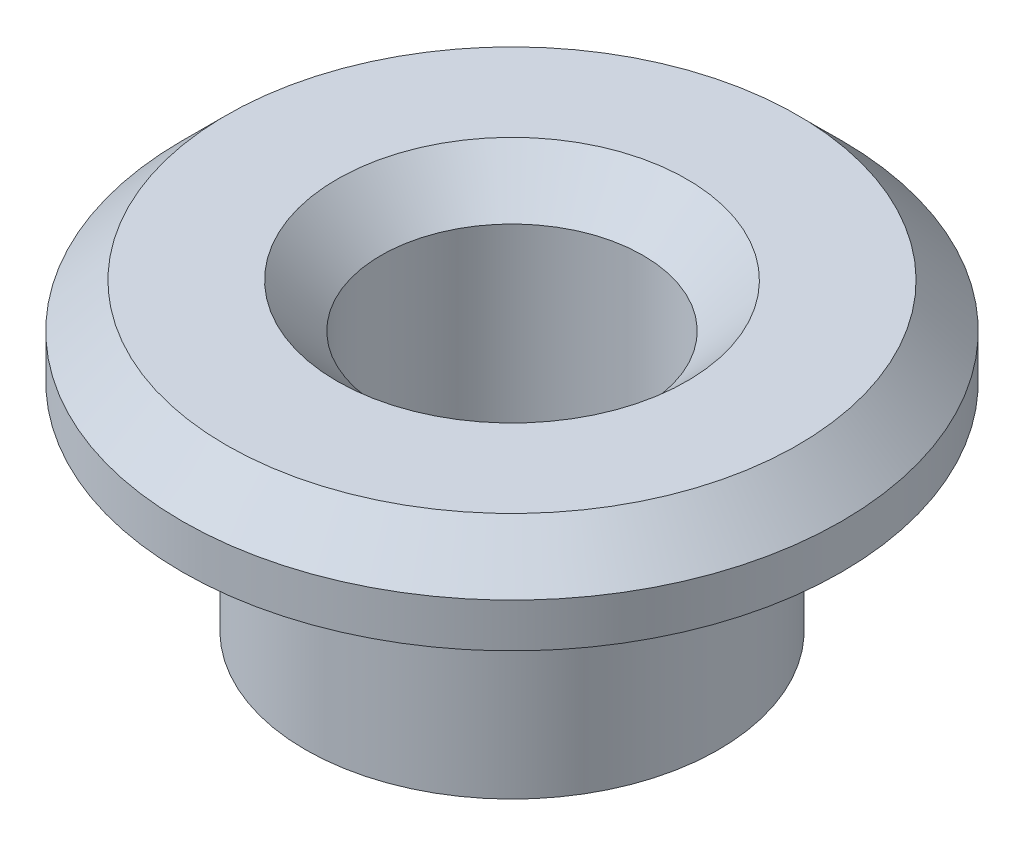
ISO-10303-21;
HEADER;
FILE_DESCRIPTION(('STEP AP214'),'2;1');
FILE_NAME('part.step','',(''),(''),'','','');
FILE_SCHEMA(('AUTOMOTIVE_DESIGN { 1 0 10303 214 1 1 1 1 }'));
ENDSEC;
DATA;
#1=APPLICATION_CONTEXT('core data for automotive mechanical design processes');
#2=APPLICATION_PROTOCOL_DEFINITION('international standard','automotive_design',2000,#1);
#3=PRODUCT_CONTEXT('',#1,'mechanical');
#4=PRODUCT('Part','Part','',(#3));
#5=PRODUCT_RELATED_PRODUCT_CATEGORY('part','',(#4));
#6=PRODUCT_DEFINITION_FORMATION('','',#4);
#7=PRODUCT_DEFINITION_CONTEXT('part definition',#1,'design');
#8=PRODUCT_DEFINITION('design','',#6,#7);
#9=PRODUCT_DEFINITION_SHAPE('','',#8);
#10=(LENGTH_UNIT() NAMED_UNIT(*) SI_UNIT(.MILLI.,.METRE.));
#11=(NAMED_UNIT(*) PLANE_ANGLE_UNIT() SI_UNIT($,.RADIAN.));
#12=(NAMED_UNIT(*) SI_UNIT($,.STERADIAN.) SOLID_ANGLE_UNIT());
#13=UNCERTAINTY_MEASURE_WITH_UNIT(LENGTH_MEASURE(1.E-05),#10,'distance_accuracy_value','');
#14=(GEOMETRIC_REPRESENTATION_CONTEXT(3) GLOBAL_UNCERTAINTY_ASSIGNED_CONTEXT((#13)) GLOBAL_UNIT_ASSIGNED_CONTEXT((#10,
#11,#12)) REPRESENTATION_CONTEXT('',''));
#15=CARTESIAN_POINT('',(0.,0.,0.));
#16=DIRECTION('',(0.,0.,1.));
#17=DIRECTION('',(1.,0.,0.));
#18=AXIS2_PLACEMENT_3D('',#15,#16,#17);
#19=CARTESIAN_POINT('',(0.,4.9,0.));
#20=DIRECTION('',(0.,-1.,0.));
#21=DIRECTION('',(0.,0.,-1.));
#22=AXIS2_PLACEMENT_3D('',#19,#20,#21);
#23=CYLINDRICAL_SURFACE('',#22,4.7);
#24=CARTESIAN_POINT('',(0.,4.9,0.));
#25=DIRECTION('',(0.,1.,0.));
#26=DIRECTION('',(0.,0.,1.));
#27=AXIS2_PLACEMENT_3D('',#24,#25,#26);
#28=CIRCLE('',#27,4.7);
#29=CARTESIAN_POINT('',(0.,4.9,4.7));
#30=VERTEX_POINT('',#29);
#31=EDGE_CURVE('E51',#30,#30,#28,.T.);
#32=ORIENTED_EDGE('',*,*,#31,.F.);
#33=EDGE_LOOP('',(#32));
#34=FACE_BOUND('',#33,.T.);
#35=CARTESIAN_POINT('',(0.,0.,0.));
#36=DIRECTION('',(0.,1.,0.));
#37=DIRECTION('',(0.,0.,1.));
#38=AXIS2_PLACEMENT_3D('',#35,#36,#37);
#39=CIRCLE('',#38,4.7);
#40=CARTESIAN_POINT('',(0.,0.,4.7));
#41=VERTEX_POINT('',#40);
#42=EDGE_CURVE('E52',#41,#41,#39,.T.);
#43=ORIENTED_EDGE('',*,*,#42,.T.);
#44=EDGE_LOOP('',(#43));
#45=FACE_BOUND('',#44,.T.);
#46=ADVANCED_FACE('F31',(#34,#45),#23,.T.);
#47=CARTESIAN_POINT('',(0.,0.,0.));
#48=DIRECTION('',(0.,1.,0.));
#49=DIRECTION('',(0.,0.,1.));
#50=AXIS2_PLACEMENT_3D('',#47,#48,#49);
#51=PLANE('',#50);
#52=CARTESIAN_POINT('',(0.,0.,0.));
#53=DIRECTION('',(0.,1.,0.));
#54=DIRECTION('',(0.,0.,1.));
#55=AXIS2_PLACEMENT_3D('',#52,#53,#54);
#56=CIRCLE('',#55,2.98);
#57=CARTESIAN_POINT('',(0.,0.,2.98));
#58=VERTEX_POINT('',#57);
#59=EDGE_CURVE('E60',#58,#58,#56,.T.);
#60=ORIENTED_EDGE('',*,*,#59,.T.);
#61=EDGE_LOOP('',(#60));
#62=FACE_BOUND('',#61,.T.);
#63=ORIENTED_EDGE('',*,*,#42,.F.);
#64=EDGE_LOOP('',(#63));
#65=FACE_BOUND('',#64,.T.);
#66=ADVANCED_FACE('F64',(#62,#65),#51,.F.);
#67=CARTESIAN_POINT('',(0.,4.9,0.));
#68=DIRECTION('',(0.,1.,0.));
#69=DIRECTION('',(0.,0.,1.));
#70=AXIS2_PLACEMENT_3D('',#67,#68,#69);
#71=PLANE('',#70);
#72=CARTESIAN_POINT('',(0.,4.9,0.));
#73=DIRECTION('',(0.,1.,0.));
#74=DIRECTION('',(0.,0.,1.));
#75=AXIS2_PLACEMENT_3D('',#72,#73,#74);
#76=CIRCLE('',#75,7.5);
#77=CARTESIAN_POINT('',(0.,4.9,7.5));
#78=VERTEX_POINT('',#77);
#79=EDGE_CURVE('E55',#78,#78,#76,.T.);
#80=ORIENTED_EDGE('',*,*,#79,.F.);
#81=EDGE_LOOP('',(#80));
#82=FACE_BOUND('',#81,.T.);
#83=ORIENTED_EDGE('',*,*,#31,.T.);
#84=EDGE_LOOP('',(#83));
#85=FACE_BOUND('',#84,.T.);
#86=ADVANCED_FACE('F86',(#82,#85),#71,.F.);
#87=CARTESIAN_POINT('',(0.,6.9,0.));
#88=DIRECTION('',(0.,-1.,0.));
#89=DIRECTION('',(0.,0.,-1.));
#90=AXIS2_PLACEMENT_3D('',#87,#88,#89);
#91=CYLINDRICAL_SURFACE('',#90,7.5);
#92=CARTESIAN_POINT('',(0.,5.9,0.));
#93=DIRECTION('',(0.,1.,0.));
#94=DIRECTION('',(0.,0.,1.));
#95=AXIS2_PLACEMENT_3D('',#92,#93,#94);
#96=CIRCLE('',#95,7.5);
#97=CARTESIAN_POINT('',(0.,5.9,7.5));
#98=VERTEX_POINT('',#97);
#99=EDGE_CURVE('E10',#98,#98,#96,.F.);
#100=ORIENTED_EDGE('',*,*,#99,.T.);
#101=EDGE_LOOP('',(#100));
#102=FACE_BOUND('',#101,.T.);
#103=ORIENTED_EDGE('',*,*,#79,.T.);
#104=EDGE_LOOP('',(#103));
#105=FACE_BOUND('',#104,.T.);
#106=ADVANCED_FACE('F78',(#102,#105),#91,.T.);
#107=CARTESIAN_POINT('',(0.,6.9,0.));
#108=DIRECTION('',(0.,1.,0.));
#109=DIRECTION('',(0.,0.,1.));
#110=AXIS2_PLACEMENT_3D('',#107,#108,#109);
#111=PLANE('',#110);
#112=CARTESIAN_POINT('',(0.,6.9,0.));
#113=DIRECTION('',(0.,1.,0.));
#114=DIRECTION('',(0.,0.,1.));
#115=AXIS2_PLACEMENT_3D('',#112,#113,#114);
#116=CIRCLE('',#115,6.5);
#117=CARTESIAN_POINT('',(0.,6.9,6.5));
#118=VERTEX_POINT('',#117);
#119=EDGE_CURVE('E38',#118,#118,#116,.T.);
#120=ORIENTED_EDGE('',*,*,#119,.T.);
#121=EDGE_LOOP('',(#120));
#122=FACE_BOUND('',#121,.T.);
#123=CARTESIAN_POINT('',(0.,6.9,0.));
#124=DIRECTION('',(0.,1.,0.));
#125=DIRECTION('',(0.,0.,1.));
#126=AXIS2_PLACEMENT_3D('',#123,#124,#125);
#127=CIRCLE('',#126,3.98000000000002);
#128=CARTESIAN_POINT('',(0.,6.9,3.98000000000002));
#129=VERTEX_POINT('',#128);
#130=EDGE_CURVE('E42',#129,#129,#127,.F.);
#131=ORIENTED_EDGE('',*,*,#130,.T.);
#132=EDGE_LOOP('',(#131));
#133=FACE_BOUND('',#132,.T.);
#134=ADVANCED_FACE('F70',(#122,#133),#111,.T.);
#135=CARTESIAN_POINT('',(0.,0.,0.));
#136=DIRECTION('',(0.,1.,0.));
#137=DIRECTION('',(0.,0.,1.));
#138=AXIS2_PLACEMENT_3D('',#135,#136,#137);
#139=CYLINDRICAL_SURFACE('',#138,2.98);
#140=CARTESIAN_POINT('',(0.,5.89999999999999,0.));
#141=DIRECTION('',(0.,1.,0.));
#142=DIRECTION('',(0.,0.,1.));
#143=AXIS2_PLACEMENT_3D('',#140,#141,#142);
#144=CIRCLE('',#143,2.98);
#145=CARTESIAN_POINT('',(0.,5.89999999999999,2.98));
#146=VERTEX_POINT('',#145);
#147=EDGE_CURVE('E46',#146,#146,#144,.T.);
#148=ORIENTED_EDGE('',*,*,#147,.T.);
#149=EDGE_LOOP('',(#148));
#150=FACE_BOUND('',#149,.T.);
#151=ORIENTED_EDGE('',*,*,#59,.F.);
#152=EDGE_LOOP('',(#151));
#153=FACE_BOUND('',#152,.T.);
#154=ADVANCED_FACE('F67',(#150,#153),#139,.F.);
#155=CARTESIAN_POINT('',(0.,5.89999999999999,0.));
#156=DIRECTION('',(0.,1.,0.));
#157=DIRECTION('',(0.,0.,1.));
#158=AXIS2_PLACEMENT_3D('',#155,#156,#157);
#159=CONICAL_SURFACE('',#158,2.98,0.78539816339745);
#160=ORIENTED_EDGE('',*,*,#130,.F.);
#161=EDGE_LOOP('',(#160));
#162=FACE_BOUND('',#161,.T.);
#163=ORIENTED_EDGE('',*,*,#147,.F.);
#164=EDGE_LOOP('',(#163));
#165=FACE_BOUND('',#164,.T.);
#166=ADVANCED_FACE('F69',(#162,#165),#159,.F.);
#167=CARTESIAN_POINT('',(0.,6.9,0.));
#168=DIRECTION('',(0.,-1.,0.));
#169=DIRECTION('',(0.,0.,-1.));
#170=AXIS2_PLACEMENT_3D('',#167,#168,#169);
#171=CONICAL_SURFACE('',#170,6.5,0.785398163397446);
#172=ORIENTED_EDGE('',*,*,#99,.F.);
#173=EDGE_LOOP('',(#172));
#174=FACE_BOUND('',#173,.T.);
#175=ORIENTED_EDGE('',*,*,#119,.F.);
#176=EDGE_LOOP('',(#175));
#177=FACE_BOUND('',#176,.T.);
#178=ADVANCED_FACE('F33',(#174,#177),#171,.T.);
#179=CLOSED_SHELL('',(#46,#66,#86,#106,#134,#154,#166,#178));
#180=MANIFOLD_SOLID_BREP('B2',#179);
#181=ADVANCED_BREP_SHAPE_REPRESENTATION('',(#18,#180),#14);
#182=SHAPE_DEFINITION_REPRESENTATION(#9,#181);
ENDSEC;
END-ISO-10303-21;
